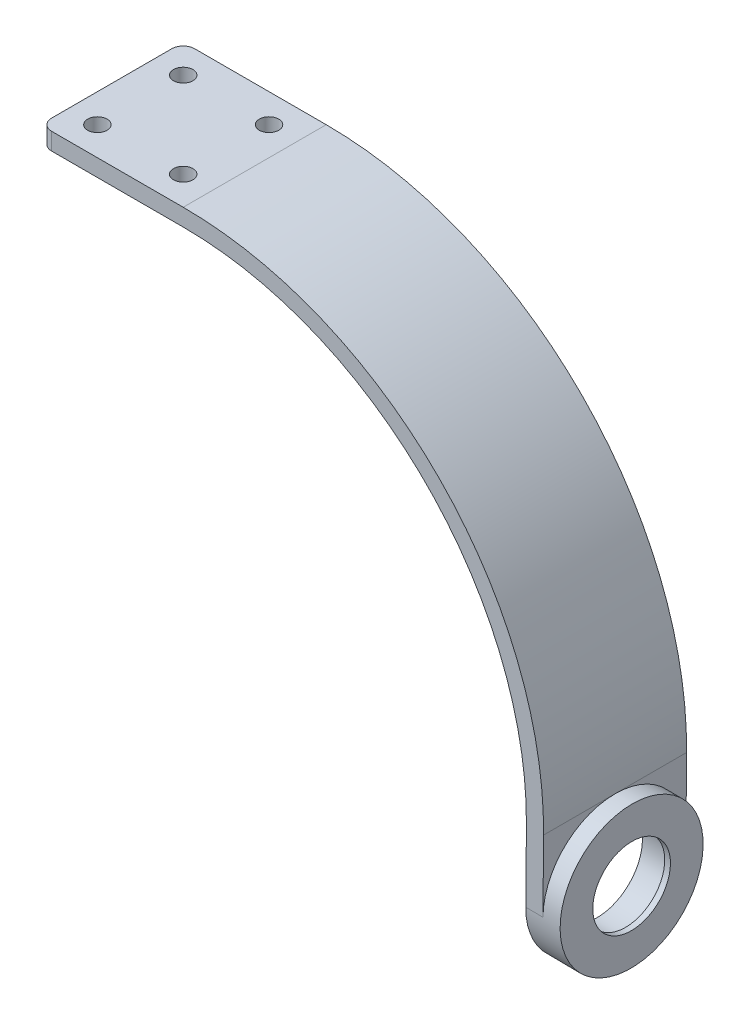
ISO-10303-21;
HEADER;
FILE_DESCRIPTION(('STEP AP214'),'2;1');
FILE_NAME('part.step','',(''),(''),'','','');
FILE_SCHEMA(('AUTOMOTIVE_DESIGN { 1 0 10303 214 1 1 1 1 }'));
ENDSEC;
DATA;
#1=APPLICATION_CONTEXT('core data for automotive mechanical design processes');
#2=APPLICATION_PROTOCOL_DEFINITION('international standard','automotive_design',2000,#1);
#3=PRODUCT_CONTEXT('',#1,'mechanical');
#4=PRODUCT('Part','Part','',(#3));
#5=PRODUCT_RELATED_PRODUCT_CATEGORY('part','',(#4));
#6=PRODUCT_DEFINITION_FORMATION('','',#4);
#7=PRODUCT_DEFINITION_CONTEXT('part definition',#1,'design');
#8=PRODUCT_DEFINITION('design','',#6,#7);
#9=PRODUCT_DEFINITION_SHAPE('','',#8);
#10=(LENGTH_UNIT() NAMED_UNIT(*) SI_UNIT(.MILLI.,.METRE.));
#11=(NAMED_UNIT(*) PLANE_ANGLE_UNIT() SI_UNIT($,.RADIAN.));
#12=(NAMED_UNIT(*) SI_UNIT($,.STERADIAN.) SOLID_ANGLE_UNIT());
#13=UNCERTAINTY_MEASURE_WITH_UNIT(LENGTH_MEASURE(1.E-05),#10,'distance_accuracy_value','');
#14=(GEOMETRIC_REPRESENTATION_CONTEXT(3) GLOBAL_UNCERTAINTY_ASSIGNED_CONTEXT((#13)) GLOBAL_UNIT_ASSIGNED_CONTEXT((#10,
#11,#12)) REPRESENTATION_CONTEXT('',''));
#15=CARTESIAN_POINT('',(0.,0.,0.));
#16=DIRECTION('',(0.,0.,1.));
#17=DIRECTION('',(1.,0.,0.));
#18=AXIS2_PLACEMENT_3D('',#15,#16,#17);
#19=CARTESIAN_POINT('',(65.8884052285056,-13.075475381195,12.5));
#20=DIRECTION('',(-0.999961923064171,0.00872653549837732,0.));
#21=DIRECTION('',(-0.00872653549837732,-0.999961923064171,0.));
#22=AXIS2_PLACEMENT_3D('',#19,#20,#21);
#23=CYLINDRICAL_SURFACE('',#22,6.79);
#24=CARTESIAN_POINT('',(65.8884052285056,-13.075475381195,12.5));
#25=DIRECTION('',(0.999961923064171,-0.00872653549837732,0.));
#26=DIRECTION('',(0.00872653549837732,0.999961923064171,0.));
#27=AXIS2_PLACEMENT_3D('',#24,#25,#26);
#28=CIRCLE('',#27,6.79);
#29=CARTESIAN_POINT('',(65.9476584045396,-6.28573392358931,12.5));
#30=VERTEX_POINT('',#29);
#31=EDGE_CURVE('E162',#30,#30,#28,.T.);
#32=ORIENTED_EDGE('',*,*,#31,.T.);
#33=EDGE_LOOP('',(#32));
#34=FACE_BOUND('',#33,.T.);
#35=CARTESIAN_POINT('',(64.8884433054415,-13.0667488456967,12.5));
#36=DIRECTION('',(-0.999961923064171,0.00872653549837732,0.));
#37=DIRECTION('',(-0.00872653549837732,-0.999961923064171,0.));
#38=AXIS2_PLACEMENT_3D('',#35,#36,#37);
#39=CIRCLE('',#38,6.79);
#40=CARTESIAN_POINT('',(64.8291901294075,-19.8564903033024,12.5));
#41=VERTEX_POINT('',#40);
#42=EDGE_CURVE('E49',#41,#41,#39,.T.);
#43=ORIENTED_EDGE('',*,*,#42,.T.);
#44=EDGE_LOOP('',(#43));
#45=FACE_BOUND('',#44,.T.);
#46=ADVANCED_FACE('F45',(#34,#45),#23,.F.);
#47=CARTESIAN_POINT('',(62.7794377655834,-25.548819813002,25.));
#48=DIRECTION('',(-0.999961923064171,0.00872653549837732,0.));
#49=DIRECTION('',(-0.00872653549837732,-0.999961923064171,0.));
#50=AXIS2_PLACEMENT_3D('',#47,#48,#49);
#51=PLANE('',#50);
#52=CARTESIAN_POINT('',(62.8885194593131,-13.0492957746999,12.5));
#53=DIRECTION('',(0.999961923064171,-0.00872653549837732,0.));
#54=DIRECTION('',(0.00872653549837732,0.999961923064171,0.));
#55=AXIS2_PLACEMENT_3D('',#52,#53,#54);
#56=CIRCLE('',#55,12.5);
#57=CARTESIAN_POINT('',(62.8885194593131,-13.0492957746999,0.));
#58=VERTEX_POINT('',#57);
#59=CARTESIAN_POINT('',(62.9976011530428,-0.54977173639774,12.5));
#60=VERTEX_POINT('',#59);
#61=EDGE_CURVE('E141',#58,#60,#56,.T.);
#62=ORIENTED_EDGE('',*,*,#61,.F.);
#63=DIRECTION('',(0.00872653549837732,0.999961923064171,0.));
#64=VECTOR('',#63,1.);
#65=CARTESIAN_POINT('',(62.7794377655834,-25.548819813002,0.));
#66=LINE('',#65,#64);
#67=CARTESIAN_POINT('',(62.9976011530428,-0.54977173639774,0.));
#68=VERTEX_POINT('',#67);
#69=EDGE_CURVE('E151',#58,#68,#66,.T.);
#70=ORIENTED_EDGE('',*,*,#69,.T.);
#71=DIRECTION('',(0.,0.,-1.));
#72=VECTOR('',#71,1.);
#73=CARTESIAN_POINT('',(62.9976011530428,-0.54977173639774,25.));
#74=LINE('',#73,#72);
#75=EDGE_CURVE('E159',#60,#68,#74,.T.);
#76=ORIENTED_EDGE('',*,*,#75,.F.);
#77=EDGE_LOOP('',(#62,#70,#76));
#78=FACE_BOUND('',#77,.T.);
#79=ADVANCED_FACE('F158',(#78),#51,.F.);
#80=CARTESIAN_POINT('',(62.8885194593131,-13.0492957746999,25.));
#81=VERTEX_POINT('',#80);
#82=EDGE_CURVE('E62',#60,#81,#56,.T.);
#83=ORIENTED_EDGE('',*,*,#82,.F.);
#84=CARTESIAN_POINT('',(62.9976011530428,-0.54977173639774,25.));
#85=VERTEX_POINT('',#84);
#86=EDGE_CURVE('E259',#85,#60,#74,.T.);
#87=ORIENTED_EDGE('',*,*,#86,.F.);
#88=DIRECTION('',(0.00872653549837732,0.999961923064171,0.));
#89=VECTOR('',#88,1.);
#90=CARTESIAN_POINT('',(62.7794377655834,-25.548819813002,25.));
#91=LINE('',#90,#89);
#92=EDGE_CURVE('E218',#81,#85,#91,.T.);
#93=ORIENTED_EDGE('',*,*,#92,.F.);
#94=EDGE_LOOP('',(#83,#87,#93));
#95=FACE_BOUND('',#94,.T.);
#96=ADVANCED_FACE('F350',(#95),#51,.F.);
#97=CARTESIAN_POINT('',(0.,63.,25.));
#98=DIRECTION('',(0.,-1.,0.));
#99=DIRECTION('',(0.,0.,-1.));
#100=AXIS2_PLACEMENT_3D('',#97,#98,#99);
#101=PLANE('',#100);
#102=CARTESIAN_POINT('',(-5.,63.,20.));
#103=DIRECTION('',(0.,1.,0.));
#104=DIRECTION('',(0.,0.,1.));
#105=AXIS2_PLACEMENT_3D('',#102,#103,#104);
#106=CIRCLE('',#105,1.69999999999999);
#107=CARTESIAN_POINT('',(-5.,63.,21.7));
#108=VERTEX_POINT('',#107);
#109=EDGE_CURVE('E184',#108,#108,#106,.T.);
#110=ORIENTED_EDGE('',*,*,#109,.F.);
#111=EDGE_LOOP('',(#110));
#112=FACE_BOUND('',#111,.T.);
#113=DIRECTION('',(0.,0.,-1.));
#114=VECTOR('',#113,1.);
#115=CARTESIAN_POINT('',(-25.,63.,25.));
#116=LINE('',#115,#114);
#117=CARTESIAN_POINT('',(-25.,63.,23.));
#118=VERTEX_POINT('',#117);
#119=CARTESIAN_POINT('',(-25.,63.,2.));
#120=VERTEX_POINT('',#119);
#121=EDGE_CURVE('E251',#118,#120,#116,.T.);
#122=ORIENTED_EDGE('',*,*,#121,.F.);
#123=CARTESIAN_POINT('',(-23.,63.,23.));
#124=DIRECTION('',(0.,-1.,0.));
#125=DIRECTION('',(0.,0.,-1.));
#126=AXIS2_PLACEMENT_3D('',#123,#124,#125);
#127=CIRCLE('',#126,2.);
#128=CARTESIAN_POINT('',(-23.,63.,25.));
#129=VERTEX_POINT('',#128);
#130=EDGE_CURVE('E55',#118,#129,#127,.F.);
#131=ORIENTED_EDGE('',*,*,#130,.T.);
#132=DIRECTION('',(-1.,0.,0.));
#133=VECTOR('',#132,1.);
#134=CARTESIAN_POINT('',(0.,63.,25.));
#135=LINE('',#134,#133);
#136=CARTESIAN_POINT('',(0.,63.,25.));
#137=VERTEX_POINT('',#136);
#138=EDGE_CURVE('E224',#137,#129,#135,.T.);
#139=ORIENTED_EDGE('',*,*,#138,.F.);
#140=DIRECTION('',(0.,0.,-1.));
#141=VECTOR('',#140,1.);
#142=CARTESIAN_POINT('',(0.,63.,25.));
#143=LINE('',#142,#141);
#144=CARTESIAN_POINT('',(0.,63.,0.));
#145=VERTEX_POINT('',#144);
#146=EDGE_CURVE('E255',#137,#145,#143,.T.);
#147=ORIENTED_EDGE('',*,*,#146,.T.);
#148=DIRECTION('',(-1.,0.,0.));
#149=VECTOR('',#148,1.);
#150=CARTESIAN_POINT('',(0.,63.,0.));
#151=LINE('',#150,#149);
#152=CARTESIAN_POINT('',(-23.,63.,0.));
#153=VERTEX_POINT('',#152);
#154=EDGE_CURVE('E239',#145,#153,#151,.T.);
#155=ORIENTED_EDGE('',*,*,#154,.T.);
#156=CARTESIAN_POINT('',(-23.,63.,2.));
#157=DIRECTION('',(0.,-1.,0.));
#158=DIRECTION('',(0.,0.,-1.));
#159=AXIS2_PLACEMENT_3D('',#156,#157,#158);
#160=CIRCLE('',#159,2.);
#161=EDGE_CURVE('E291',#153,#120,#160,.F.);
#162=ORIENTED_EDGE('',*,*,#161,.T.);
#163=EDGE_LOOP('',(#122,#131,#139,#147,#155,#162));
#164=FACE_BOUND('',#163,.T.);
#165=CARTESIAN_POINT('',(-5.,63.,5.));
#166=DIRECTION('',(0.,1.,0.));
#167=DIRECTION('',(0.,0.,1.));
#168=AXIS2_PLACEMENT_3D('',#165,#166,#167);
#169=CIRCLE('',#168,1.69999999999999);
#170=CARTESIAN_POINT('',(-5.,63.,6.69999999999999));
#171=VERTEX_POINT('',#170);
#172=EDGE_CURVE('E200',#171,#171,#169,.T.);
#173=ORIENTED_EDGE('',*,*,#172,.F.);
#174=EDGE_LOOP('',(#173));
#175=FACE_BOUND('',#174,.T.);
#176=CARTESIAN_POINT('',(-20.,63.,20.));
#177=DIRECTION('',(0.,1.,0.));
#178=DIRECTION('',(0.,0.,1.));
#179=AXIS2_PLACEMENT_3D('',#176,#177,#178);
#180=CIRCLE('',#179,1.69999999999999);
#181=CARTESIAN_POINT('',(-20.,63.,21.7));
#182=VERTEX_POINT('',#181);
#183=EDGE_CURVE('E192',#182,#182,#180,.T.);
#184=ORIENTED_EDGE('',*,*,#183,.F.);
#185=EDGE_LOOP('',(#184));
#186=FACE_BOUND('',#185,.T.);
#187=CARTESIAN_POINT('',(-20.,63.,5.));
#188=DIRECTION('',(0.,1.,0.));
#189=DIRECTION('',(0.,0.,1.));
#190=AXIS2_PLACEMENT_3D('',#187,#188,#189);
#191=CIRCLE('',#190,1.69999999999999);
#192=CARTESIAN_POINT('',(-20.,63.,6.69999999999999));
#193=VERTEX_POINT('',#192);
#194=EDGE_CURVE('E175',#193,#193,#191,.T.);
#195=ORIENTED_EDGE('',*,*,#194,.F.);
#196=EDGE_LOOP('',(#195));
#197=FACE_BOUND('',#196,.T.);
#198=ADVANCED_FACE('F299',(#112,#164,#175,#186,#197),#101,.F.);
#199=CARTESIAN_POINT('',(0.,0.,25.));
#200=DIRECTION('',(0.,0.,-1.));
#201=DIRECTION('',(-1.,0.,0.));
#202=AXIS2_PLACEMENT_3D('',#199,#200,#201);
#203=CYLINDRICAL_SURFACE('',#202,60.);
#204=CARTESIAN_POINT('',(0.,0.,0.));
#205=DIRECTION('',(0.,0.,-1.));
#206=DIRECTION('',(-1.,0.,0.));
#207=AXIS2_PLACEMENT_3D('',#204,#205,#206);
#208=CIRCLE('',#207,60.);
#209=CARTESIAN_POINT('',(0.,60.,0.));
#210=VERTEX_POINT('',#209);
#211=CARTESIAN_POINT('',(59.9977153838503,-0.523592129902636,0.));
#212=VERTEX_POINT('',#211);
#213=EDGE_CURVE('E208',#210,#212,#208,.T.);
#214=ORIENTED_EDGE('',*,*,#213,.T.);
#215=DIRECTION('',(0.,0.,-1.));
#216=VECTOR('',#215,1.);
#217=CARTESIAN_POINT('',(59.9977153838503,-0.523592129902636,25.));
#218=LINE('',#217,#216);
#219=CARTESIAN_POINT('',(59.9977153838503,-0.523592129902636,25.));
#220=VERTEX_POINT('',#219);
#221=EDGE_CURVE('E147',#220,#212,#218,.T.);
#222=ORIENTED_EDGE('',*,*,#221,.F.);
#223=CARTESIAN_POINT('',(0.,0.,25.));
#224=DIRECTION('',(0.,0.,-1.));
#225=DIRECTION('',(-1.,0.,0.));
#226=AXIS2_PLACEMENT_3D('',#223,#224,#225);
#227=CIRCLE('',#226,60.);
#228=CARTESIAN_POINT('',(0.,60.,25.));
#229=VERTEX_POINT('',#228);
#230=EDGE_CURVE('E209',#229,#220,#227,.T.);
#231=ORIENTED_EDGE('',*,*,#230,.F.);
#232=DIRECTION('',(0.,0.,-1.));
#233=VECTOR('',#232,1.);
#234=CARTESIAN_POINT('',(0.,60.,25.));
#235=LINE('',#234,#233);
#236=EDGE_CURVE('E231',#229,#210,#235,.T.);
#237=ORIENTED_EDGE('',*,*,#236,.T.);
#238=EDGE_LOOP('',(#214,#222,#231,#237));
#239=FACE_BOUND('',#238,.T.);
#240=ADVANCED_FACE('F322',(#239),#203,.F.);
#241=CARTESIAN_POINT('',(59.9977153838503,-0.523592129902636,25.));
#242=DIRECTION('',(0.999961923064171,-0.00872653549837788,0.));
#243=DIRECTION('',(0.00872653549837788,0.999961923064171,0.));
#244=AXIS2_PLACEMENT_3D('',#241,#242,#243);
#245=PLANE('',#244);
#246=CARTESIAN_POINT('',(59.8886336901206,-13.0231161682048,12.5));
#247=DIRECTION('',(0.999961923064171,-0.00872653549837788,0.));
#248=DIRECTION('',(0.00872653549837788,0.999961923064171,0.));
#249=AXIS2_PLACEMENT_3D('',#246,#247,#248);
#250=CIRCLE('',#249,7.89);
#251=CARTESIAN_POINT('',(59.9574860552028,-5.13341659522846,12.5));
#252=VERTEX_POINT('',#251);
#253=EDGE_CURVE('E171',#252,#252,#250,.F.);
#254=ORIENTED_EDGE('',*,*,#253,.F.);
#255=EDGE_LOOP('',(#254));
#256=FACE_BOUND('',#255,.T.);
#257=DIRECTION('',(-0.00872653549837788,-0.999961923064171,0.));
#258=VECTOR('',#257,1.);
#259=CARTESIAN_POINT('',(59.9977153838503,-0.523592129902636,0.));
#260=LINE('',#259,#258);
#261=CARTESIAN_POINT('',(59.8886336901206,-13.0231161682048,0.));
#262=VERTEX_POINT('',#261);
#263=EDGE_CURVE('E156',#212,#262,#260,.T.);
#264=ORIENTED_EDGE('',*,*,#263,.T.);
#265=CARTESIAN_POINT('',(59.8886336901206,-13.0231161682048,12.5));
#266=DIRECTION('',(0.999961923064171,-0.00872653549837788,0.));
#267=DIRECTION('',(0.00872653549837788,0.999961923064171,0.));
#268=AXIS2_PLACEMENT_3D('',#265,#266,#267);
#269=CIRCLE('',#268,12.5);
#270=CARTESIAN_POINT('',(59.7795519963908,-25.5226402065069,12.5));
#271=VERTEX_POINT('',#270);
#272=EDGE_CURVE('E143',#262,#271,#269,.F.);
#273=ORIENTED_EDGE('',*,*,#272,.T.);
#274=CARTESIAN_POINT('',(59.8886336901206,-13.0231161682048,12.5));
#275=DIRECTION('',(0.999961923064171,-0.00872653549837788,0.));
#276=DIRECTION('',(0.00872653549837788,0.999961923064171,0.));
#277=AXIS2_PLACEMENT_3D('',#274,#275,#276);
#278=CIRCLE('',#277,12.5);
#279=CARTESIAN_POINT('',(59.8886336901206,-13.0231161682048,25.));
#280=VERTEX_POINT('',#279);
#281=EDGE_CURVE('E146',#271,#280,#278,.F.);
#282=ORIENTED_EDGE('',*,*,#281,.T.);
#283=DIRECTION('',(-0.00872653549837788,-0.999961923064171,0.));
#284=VECTOR('',#283,1.);
#285=CARTESIAN_POINT('',(59.9977153838503,-0.523592129902636,25.));
#286=LINE('',#285,#284);
#287=EDGE_CURVE('E213',#220,#280,#286,.T.);
#288=ORIENTED_EDGE('',*,*,#287,.F.);
#289=ORIENTED_EDGE('',*,*,#221,.T.);
#290=EDGE_LOOP('',(#264,#273,#282,#288,#289));
#291=FACE_BOUND('',#290,.T.);
#292=ADVANCED_FACE('F326',(#256,#291),#245,.F.);
#293=CARTESIAN_POINT('',(0.,0.,25.));
#294=DIRECTION('',(0.,0.,-1.));
#295=DIRECTION('',(-1.,0.,0.));
#296=AXIS2_PLACEMENT_3D('',#293,#294,#295);
#297=CYLINDRICAL_SURFACE('',#296,63.);
#298=CARTESIAN_POINT('',(0.,0.,0.));
#299=DIRECTION('',(0.,0.,1.));
#300=DIRECTION('',(-1.,0.,0.));
#301=AXIS2_PLACEMENT_3D('',#298,#299,#300);
#302=CIRCLE('',#301,63.);
#303=EDGE_CURVE('E153',#68,#145,#302,.T.);
#304=ORIENTED_EDGE('',*,*,#303,.T.);
#305=ORIENTED_EDGE('',*,*,#146,.F.);
#306=CARTESIAN_POINT('',(0.,0.,25.));
#307=DIRECTION('',(0.,0.,1.));
#308=DIRECTION('',(-1.,0.,0.));
#309=AXIS2_PLACEMENT_3D('',#306,#307,#308);
#310=CIRCLE('',#309,63.);
#311=EDGE_CURVE('E221',#85,#137,#310,.T.);
#312=ORIENTED_EDGE('',*,*,#311,.F.);
#313=ORIENTED_EDGE('',*,*,#86,.T.);
#314=ORIENTED_EDGE('',*,*,#75,.T.);
#315=EDGE_LOOP('',(#304,#305,#312,#313,#314));
#316=FACE_BOUND('',#315,.T.);
#317=ADVANCED_FACE('F328',(#316),#297,.T.);
#318=CARTESIAN_POINT('',(-25.,63.,25.));
#319=DIRECTION('',(1.,0.,0.));
#320=DIRECTION('',(0.,0.,-1.));
#321=AXIS2_PLACEMENT_3D('',#318,#319,#320);
#322=PLANE('',#321);
#323=DIRECTION('',(0.,0.,-1.));
#324=VECTOR('',#323,1.);
#325=CARTESIAN_POINT('',(-25.,60.,25.));
#326=LINE('',#325,#324);
#327=CARTESIAN_POINT('',(-25.,60.,23.));
#328=VERTEX_POINT('',#327);
#329=CARTESIAN_POINT('',(-25.,60.,2.));
#330=VERTEX_POINT('',#329);
#331=EDGE_CURVE('E247',#328,#330,#326,.T.);
#332=ORIENTED_EDGE('',*,*,#331,.F.);
#333=DIRECTION('',(0.,-1.,0.));
#334=VECTOR('',#333,1.);
#335=CARTESIAN_POINT('',(-25.,63.,23.));
#336=LINE('',#335,#334);
#337=EDGE_CURVE('E288',#328,#118,#336,.F.);
#338=ORIENTED_EDGE('',*,*,#337,.T.);
#339=ORIENTED_EDGE('',*,*,#121,.T.);
#340=DIRECTION('',(0.,-1.,0.));
#341=VECTOR('',#340,1.);
#342=CARTESIAN_POINT('',(-25.,60.,2.));
#343=LINE('',#342,#341);
#344=EDGE_CURVE('E284',#120,#330,#343,.T.);
#345=ORIENTED_EDGE('',*,*,#344,.T.);
#346=EDGE_LOOP('',(#332,#338,#339,#345));
#347=FACE_BOUND('',#346,.T.);
#348=ADVANCED_FACE('F315',(#347),#322,.F.);
#349=CARTESIAN_POINT('',(-25.,60.,25.));
#350=DIRECTION('',(0.,1.,0.));
#351=DIRECTION('',(0.,0.,1.));
#352=AXIS2_PLACEMENT_3D('',#349,#350,#351);
#353=PLANE('',#352);
#354=CARTESIAN_POINT('',(-20.,60.,5.));
#355=DIRECTION('',(0.,1.,0.));
#356=DIRECTION('',(0.,0.,1.));
#357=AXIS2_PLACEMENT_3D('',#354,#355,#356);
#358=CIRCLE('',#357,1.69999999999999);
#359=CARTESIAN_POINT('',(-20.,60.,6.69999999999999));
#360=VERTEX_POINT('',#359);
#361=EDGE_CURVE('E180',#360,#360,#358,.T.);
#362=ORIENTED_EDGE('',*,*,#361,.T.);
#363=EDGE_LOOP('',(#362));
#364=FACE_BOUND('',#363,.T.);
#365=CARTESIAN_POINT('',(-5.,60.,20.));
#366=DIRECTION('',(0.,1.,0.));
#367=DIRECTION('',(0.,0.,1.));
#368=AXIS2_PLACEMENT_3D('',#365,#366,#367);
#369=CIRCLE('',#368,1.7);
#370=CARTESIAN_POINT('',(-5.,60.,21.7));
#371=VERTEX_POINT('',#370);
#372=EDGE_CURVE('E188',#371,#371,#369,.T.);
#373=ORIENTED_EDGE('',*,*,#372,.T.);
#374=EDGE_LOOP('',(#373));
#375=FACE_BOUND('',#374,.T.);
#376=CARTESIAN_POINT('',(-20.,60.,20.));
#377=DIRECTION('',(0.,1.,0.));
#378=DIRECTION('',(0.,0.,1.));
#379=AXIS2_PLACEMENT_3D('',#376,#377,#378);
#380=CIRCLE('',#379,1.69999999999999);
#381=CARTESIAN_POINT('',(-20.,60.,21.7));
#382=VERTEX_POINT('',#381);
#383=EDGE_CURVE('E196',#382,#382,#380,.T.);
#384=ORIENTED_EDGE('',*,*,#383,.T.);
#385=EDGE_LOOP('',(#384));
#386=FACE_BOUND('',#385,.T.);
#387=CARTESIAN_POINT('',(-5.,60.,5.));
#388=DIRECTION('',(0.,1.,0.));
#389=DIRECTION('',(0.,0.,1.));
#390=AXIS2_PLACEMENT_3D('',#387,#388,#389);
#391=CIRCLE('',#390,1.7);
#392=CARTESIAN_POINT('',(-5.,60.,6.69999999999999));
#393=VERTEX_POINT('',#392);
#394=EDGE_CURVE('E204',#393,#393,#391,.T.);
#395=ORIENTED_EDGE('',*,*,#394,.T.);
#396=EDGE_LOOP('',(#395));
#397=FACE_BOUND('',#396,.T.);
#398=DIRECTION('',(1.,0.,0.));
#399=VECTOR('',#398,1.);
#400=CARTESIAN_POINT('',(-25.,60.,25.));
#401=LINE('',#400,#399);
#402=CARTESIAN_POINT('',(-23.,60.,25.));
#403=VERTEX_POINT('',#402);
#404=EDGE_CURVE('E228',#403,#229,#401,.T.);
#405=ORIENTED_EDGE('',*,*,#404,.F.);
#406=CARTESIAN_POINT('',(-23.,60.,23.));
#407=DIRECTION('',(0.,1.,0.));
#408=DIRECTION('',(0.,0.,1.));
#409=AXIS2_PLACEMENT_3D('',#406,#407,#408);
#410=CIRCLE('',#409,2.);
#411=EDGE_CURVE('E281',#403,#328,#410,.F.);
#412=ORIENTED_EDGE('',*,*,#411,.T.);
#413=ORIENTED_EDGE('',*,*,#331,.T.);
#414=CARTESIAN_POINT('',(-23.,60.,2.));
#415=DIRECTION('',(0.,1.,0.));
#416=DIRECTION('',(0.,0.,1.));
#417=AXIS2_PLACEMENT_3D('',#414,#415,#416);
#418=CIRCLE('',#417,2.);
#419=CARTESIAN_POINT('',(-23.,60.,0.));
#420=VERTEX_POINT('',#419);
#421=EDGE_CURVE('E278',#330,#420,#418,.F.);
#422=ORIENTED_EDGE('',*,*,#421,.T.);
#423=DIRECTION('',(1.,0.,0.));
#424=VECTOR('',#423,1.);
#425=CARTESIAN_POINT('',(-25.,60.,0.));
#426=LINE('',#425,#424);
#427=EDGE_CURVE('E214',#420,#210,#426,.T.);
#428=ORIENTED_EDGE('',*,*,#427,.T.);
#429=ORIENTED_EDGE('',*,*,#236,.F.);
#430=EDGE_LOOP('',(#405,#412,#413,#422,#428,#429));
#431=FACE_BOUND('',#430,.T.);
#432=ADVANCED_FACE('F312',(#364,#375,#386,#397,#431),#353,.F.);
#433=CARTESIAN_POINT('',(0.,0.,25.));
#434=DIRECTION('',(0.,0.,-1.));
#435=DIRECTION('',(-1.,0.,0.));
#436=AXIS2_PLACEMENT_3D('',#433,#434,#435);
#437=PLANE('',#436);
#438=ORIENTED_EDGE('',*,*,#138,.T.);
#439=DIRECTION('',(0.,-1.,0.));
#440=VECTOR('',#439,1.);
#441=CARTESIAN_POINT('',(-23.,0.,25.));
#442=LINE('',#441,#440);
#443=EDGE_CURVE('E272',#129,#403,#442,.T.);
#444=ORIENTED_EDGE('',*,*,#443,.T.);
#445=ORIENTED_EDGE('',*,*,#404,.T.);
#446=ORIENTED_EDGE('',*,*,#230,.T.);
#447=ORIENTED_EDGE('',*,*,#287,.T.);
#448=DIRECTION('',(0.999961923064171,-0.00872653549837647,0.));
#449=VECTOR('',#448,1.);
#450=CARTESIAN_POINT('',(-0.109081693729706,-12.4995240383022,25.));
#451=LINE('',#450,#449);
#452=EDGE_CURVE('E269',#280,#81,#451,.T.);
#453=ORIENTED_EDGE('',*,*,#452,.T.);
#454=ORIENTED_EDGE('',*,*,#92,.T.);
#455=ORIENTED_EDGE('',*,*,#311,.T.);
#456=EDGE_LOOP('',(#438,#444,#445,#446,#447,#453,#454,#455));
#457=FACE_BOUND('',#456,.T.);
#458=ADVANCED_FACE('F305',(#457),#437,.F.);
#459=CARTESIAN_POINT('',(0.,0.,0.));
#460=DIRECTION('',(0.,0.,-1.));
#461=DIRECTION('',(-1.,0.,0.));
#462=AXIS2_PLACEMENT_3D('',#459,#460,#461);
#463=PLANE('',#462);
#464=ORIENTED_EDGE('',*,*,#427,.F.);
#465=DIRECTION('',(0.,-1.,0.));
#466=VECTOR('',#465,1.);
#467=CARTESIAN_POINT('',(-23.,63.,0.));
#468=LINE('',#467,#466);
#469=EDGE_CURVE('E11',#420,#153,#468,.F.);
#470=ORIENTED_EDGE('',*,*,#469,.T.);
#471=ORIENTED_EDGE('',*,*,#154,.F.);
#472=ORIENTED_EDGE('',*,*,#303,.F.);
#473=ORIENTED_EDGE('',*,*,#69,.F.);
#474=DIRECTION('',(0.999961923064171,-0.00872653549837647,0.));
#475=VECTOR('',#474,1.);
#476=CARTESIAN_POINT('',(59.8886336901205,-13.0231161682048,0.));
#477=LINE('',#476,#475);
#478=EDGE_CURVE('E135',#58,#262,#477,.F.);
#479=ORIENTED_EDGE('',*,*,#478,.T.);
#480=ORIENTED_EDGE('',*,*,#263,.F.);
#481=ORIENTED_EDGE('',*,*,#213,.F.);
#482=EDGE_LOOP('',(#464,#470,#471,#472,#473,#479,#480,#481));
#483=FACE_BOUND('',#482,.T.);
#484=ADVANCED_FACE('F152',(#483),#463,.T.);
#485=CARTESIAN_POINT('',(-5.,63.,5.));
#486=DIRECTION('',(0.,1.,0.));
#487=DIRECTION('',(0.,0.,1.));
#488=AXIS2_PLACEMENT_3D('',#485,#486,#487);
#489=CYLINDRICAL_SURFACE('',#488,1.7);
#490=ORIENTED_EDGE('',*,*,#394,.F.);
#491=EDGE_LOOP('',(#490));
#492=FACE_BOUND('',#491,.T.);
#493=ORIENTED_EDGE('',*,*,#172,.T.);
#494=EDGE_LOOP('',(#493));
#495=FACE_BOUND('',#494,.T.);
#496=ADVANCED_FACE('F371',(#492,#495),#489,.F.);
#497=CARTESIAN_POINT('',(-20.,63.,20.));
#498=DIRECTION('',(0.,1.,0.));
#499=DIRECTION('',(0.,0.,1.));
#500=AXIS2_PLACEMENT_3D('',#497,#498,#499);
#501=CYLINDRICAL_SURFACE('',#500,1.69999999999999);
#502=ORIENTED_EDGE('',*,*,#383,.F.);
#503=EDGE_LOOP('',(#502));
#504=FACE_BOUND('',#503,.T.);
#505=ORIENTED_EDGE('',*,*,#183,.T.);
#506=EDGE_LOOP('',(#505));
#507=FACE_BOUND('',#506,.T.);
#508=ADVANCED_FACE('F367',(#504,#507),#501,.F.);
#509=CARTESIAN_POINT('',(-5.,63.,20.));
#510=DIRECTION('',(0.,1.,0.));
#511=DIRECTION('',(0.,0.,1.));
#512=AXIS2_PLACEMENT_3D('',#509,#510,#511);
#513=CYLINDRICAL_SURFACE('',#512,1.7);
#514=ORIENTED_EDGE('',*,*,#372,.F.);
#515=EDGE_LOOP('',(#514));
#516=FACE_BOUND('',#515,.T.);
#517=ORIENTED_EDGE('',*,*,#109,.T.);
#518=EDGE_LOOP('',(#517));
#519=FACE_BOUND('',#518,.T.);
#520=ADVANCED_FACE('F363',(#516,#519),#513,.F.);
#521=CARTESIAN_POINT('',(-20.,63.,5.));
#522=DIRECTION('',(0.,1.,0.));
#523=DIRECTION('',(0.,0.,1.));
#524=AXIS2_PLACEMENT_3D('',#521,#522,#523);
#525=CYLINDRICAL_SURFACE('',#524,1.69999999999999);
#526=ORIENTED_EDGE('',*,*,#361,.F.);
#527=EDGE_LOOP('',(#526));
#528=FACE_BOUND('',#527,.T.);
#529=ORIENTED_EDGE('',*,*,#194,.T.);
#530=EDGE_LOOP('',(#529));
#531=FACE_BOUND('',#530,.T.);
#532=ADVANCED_FACE('F360',(#528,#531),#525,.F.);
#533=CARTESIAN_POINT('',(-25.6579373360101,-12.2765625529067,12.5));
#534=DIRECTION('',(0.999961923064171,-0.00872653549837732,0.));
#535=DIRECTION('',(0.00872653549837732,0.999961923064171,0.));
#536=AXIS2_PLACEMENT_3D('',#533,#534,#535);
#537=CYLINDRICAL_SURFACE('',#536,7.89);
#538=ORIENTED_EDGE('',*,*,#253,.T.);
#539=EDGE_LOOP('',(#538));
#540=FACE_BOUND('',#539,.T.);
#541=CARTESIAN_POINT('',(64.8884433054415,-13.0667488456967,12.5));
#542=DIRECTION('',(-0.999961923064171,0.00872653549837732,0.));
#543=DIRECTION('',(-0.00872653549837732,-0.999961923064171,0.));
#544=AXIS2_PLACEMENT_3D('',#541,#542,#543);
#545=CIRCLE('',#544,7.89);
#546=CARTESIAN_POINT('',(64.8195909403593,-20.956448418673,12.5));
#547=VERTEX_POINT('',#546);
#548=EDGE_CURVE('E452',#547,#547,#545,.T.);
#549=ORIENTED_EDGE('',*,*,#548,.F.);
#550=EDGE_LOOP('',(#549));
#551=FACE_BOUND('',#550,.T.);
#552=ADVANCED_FACE('F358',(#540,#551),#537,.F.);
#553=CARTESIAN_POINT('',(-0.109081693729706,-12.4995240383022,12.5));
#554=DIRECTION('',(0.999961923064171,-0.00872653549837647,0.));
#555=DIRECTION('',(0.00872653549837647,0.999961923064171,0.));
#556=AXIS2_PLACEMENT_3D('',#553,#554,#555);
#557=CYLINDRICAL_SURFACE('',#556,12.5);
#558=ORIENTED_EDGE('',*,*,#452,.F.);
#559=ORIENTED_EDGE('',*,*,#281,.F.);
#560=DIRECTION('',(0.999961923064171,-0.00872653549837647,0.));
#561=VECTOR('',#560,1.);
#562=CARTESIAN_POINT('',(59.7795519963908,-25.5226402065069,12.5));
#563=LINE('',#562,#561);
#564=CARTESIAN_POINT('',(62.7794377655834,-25.548819813002,12.5));
#565=VERTEX_POINT('',#564);
#566=EDGE_CURVE('E176',#565,#271,#563,.F.);
#567=ORIENTED_EDGE('',*,*,#566,.F.);
#568=ORIENTED_EDGE('',*,*,#566,.T.);
#569=ORIENTED_EDGE('',*,*,#272,.F.);
#570=ORIENTED_EDGE('',*,*,#478,.F.);
#571=ORIENTED_EDGE('',*,*,#61,.T.);
#572=ORIENTED_EDGE('',*,*,#82,.T.);
#573=EDGE_LOOP('',(#558,#559,#567,#568,#569,#570,#571,#572));
#574=FACE_BOUND('',#573,.T.);
#575=CARTESIAN_POINT('',(65.8884052285056,-13.075475381195,12.5));
#576=DIRECTION('',(0.999961923064171,-0.00872653549837732,0.));
#577=DIRECTION('',(0.00872653549837732,0.999961923064171,0.));
#578=AXIS2_PLACEMENT_3D('',#575,#576,#577);
#579=CIRCLE('',#578,12.5);
#580=CARTESIAN_POINT('',(65.9974869222354,-0.575951342892882,12.5));
#581=VERTEX_POINT('',#580);
#582=EDGE_CURVE('E166',#581,#581,#579,.T.);
#583=ORIENTED_EDGE('',*,*,#582,.F.);
#584=EDGE_LOOP('',(#583));
#585=FACE_BOUND('',#584,.T.);
#586=ADVANCED_FACE('F138',(#574,#585),#557,.T.);
#587=CARTESIAN_POINT('',(-23.,0.,23.));
#588=DIRECTION('',(0.,-1.,0.));
#589=DIRECTION('',(0.,0.,-1.));
#590=AXIS2_PLACEMENT_3D('',#587,#588,#589);
#591=CYLINDRICAL_SURFACE('',#590,2.);
#592=ORIENTED_EDGE('',*,*,#130,.F.);
#593=ORIENTED_EDGE('',*,*,#337,.F.);
#594=ORIENTED_EDGE('',*,*,#411,.F.);
#595=ORIENTED_EDGE('',*,*,#443,.F.);
#596=EDGE_LOOP('',(#592,#593,#594,#595));
#597=FACE_BOUND('',#596,.T.);
#598=ADVANCED_FACE('F309',(#597),#591,.T.);
#599=CARTESIAN_POINT('',(-23.,63.,2.));
#600=DIRECTION('',(0.,1.,0.));
#601=DIRECTION('',(0.,0.,1.));
#602=AXIS2_PLACEMENT_3D('',#599,#600,#601);
#603=CYLINDRICAL_SURFACE('',#602,2.);
#604=ORIENTED_EDGE('',*,*,#161,.F.);
#605=ORIENTED_EDGE('',*,*,#469,.F.);
#606=ORIENTED_EDGE('',*,*,#421,.F.);
#607=ORIENTED_EDGE('',*,*,#344,.F.);
#608=EDGE_LOOP('',(#604,#605,#606,#607));
#609=FACE_BOUND('',#608,.T.);
#610=ADVANCED_FACE('F47',(#609),#603,.T.);
#611=CARTESIAN_POINT('',(65.8884052285056,-13.075475381195,12.5));
#612=DIRECTION('',(0.999961923064171,-0.00872653549837732,0.));
#613=DIRECTION('',(0.00872653549837732,0.999961923064171,0.));
#614=AXIS2_PLACEMENT_3D('',#611,#612,#613);
#615=PLANE('',#614);
#616=ORIENTED_EDGE('',*,*,#582,.T.);
#617=EDGE_LOOP('',(#616));
#618=FACE_BOUND('',#617,.T.);
#619=ORIENTED_EDGE('',*,*,#31,.F.);
#620=EDGE_LOOP('',(#619));
#621=FACE_BOUND('',#620,.T.);
#622=ADVANCED_FACE('F355',(#618,#621),#615,.T.);
#623=CARTESIAN_POINT('',(64.8884433054415,-13.0667488456967,12.5));
#624=DIRECTION('',(-0.999961923064171,0.00872653549837732,0.));
#625=DIRECTION('',(-0.00872653549837732,-0.999961923064171,0.));
#626=AXIS2_PLACEMENT_3D('',#623,#624,#625);
#627=PLANE('',#626);
#628=ORIENTED_EDGE('',*,*,#42,.F.);
#629=EDGE_LOOP('',(#628));
#630=FACE_BOUND('',#629,.T.);
#631=ORIENTED_EDGE('',*,*,#548,.T.);
#632=EDGE_LOOP('',(#631));
#633=FACE_BOUND('',#632,.T.);
#634=ADVANCED_FACE('F354',(#630,#633),#627,.T.);
#635=CLOSED_SHELL('',(#46,#79,#96,#198,#240,#292,#317,#348,#432,#458,#484,#496,#508,#520,#532,
#552,#586,#598,#610,#622,#634));
#636=MANIFOLD_SOLID_BREP('B2',#635);
#637=ADVANCED_BREP_SHAPE_REPRESENTATION('',(#18,#636),#14);
#638=SHAPE_DEFINITION_REPRESENTATION(#9,#637);
ENDSEC;
END-ISO-10303-21;
